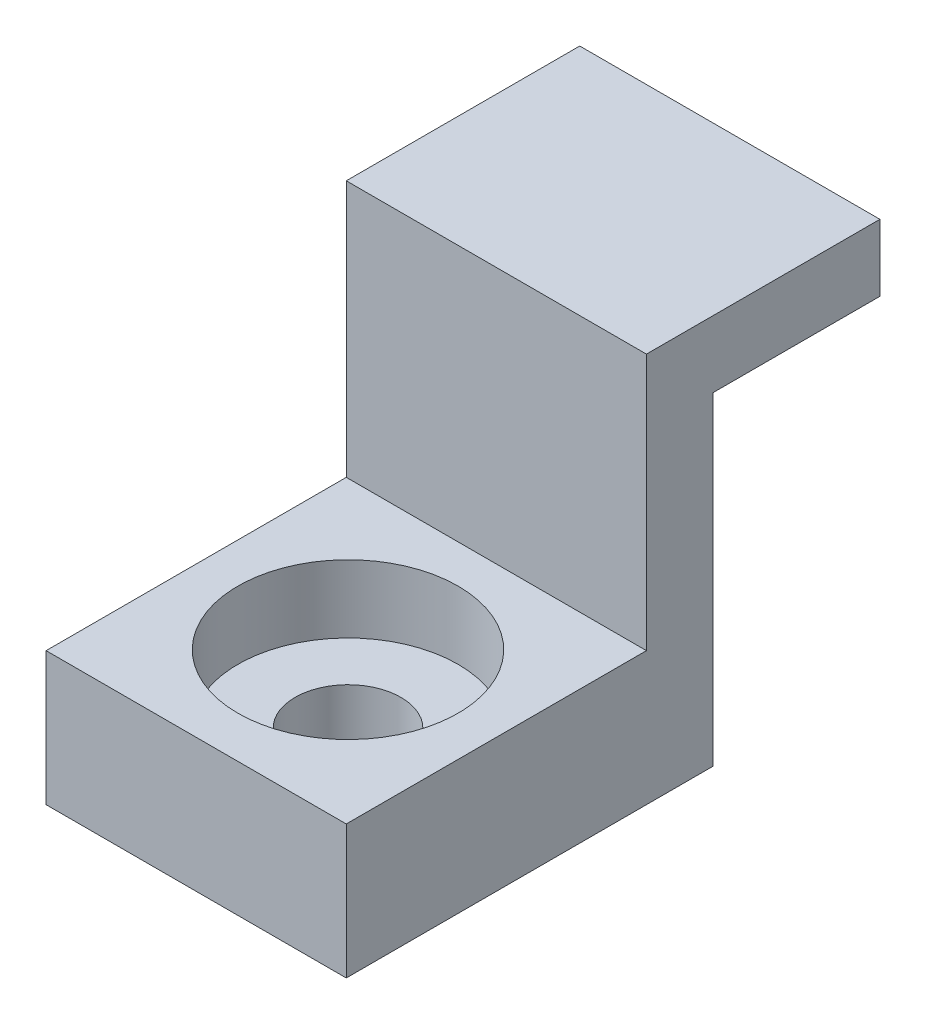
ISO-10303-21;
HEADER;
FILE_DESCRIPTION(('STEP AP214'),'2;1');
FILE_NAME('part.step','',(''),(''),'','','');
FILE_SCHEMA(('AUTOMOTIVE_DESIGN { 1 0 10303 214 1 1 1 1 }'));
ENDSEC;
DATA;
#1=APPLICATION_CONTEXT('core data for automotive mechanical design processes');
#2=APPLICATION_PROTOCOL_DEFINITION('international standard','automotive_design',2000,#1);
#3=PRODUCT_CONTEXT('',#1,'mechanical');
#4=PRODUCT('Part','Part','',(#3));
#5=PRODUCT_RELATED_PRODUCT_CATEGORY('part','',(#4));
#6=PRODUCT_DEFINITION_FORMATION('','',#4);
#7=PRODUCT_DEFINITION_CONTEXT('part definition',#1,'design');
#8=PRODUCT_DEFINITION('design','',#6,#7);
#9=PRODUCT_DEFINITION_SHAPE('','',#8);
#10=(LENGTH_UNIT() NAMED_UNIT(*) SI_UNIT(.MILLI.,.METRE.));
#11=(NAMED_UNIT(*) PLANE_ANGLE_UNIT() SI_UNIT($,.RADIAN.));
#12=(NAMED_UNIT(*) SI_UNIT($,.STERADIAN.) SOLID_ANGLE_UNIT());
#13=UNCERTAINTY_MEASURE_WITH_UNIT(LENGTH_MEASURE(1.E-05),#10,'distance_accuracy_value','');
#14=(GEOMETRIC_REPRESENTATION_CONTEXT(3) GLOBAL_UNCERTAINTY_ASSIGNED_CONTEXT((#13)) GLOBAL_UNIT_ASSIGNED_CONTEXT((#10,
#11,#12)) REPRESENTATION_CONTEXT('',''));
#15=CARTESIAN_POINT('',(0.,0.,0.));
#16=DIRECTION('',(0.,0.,1.));
#17=DIRECTION('',(1.,0.,0.));
#18=AXIS2_PLACEMENT_3D('',#15,#16,#17);
#19=CARTESIAN_POINT('',(-92.4300833436291,-1.25000000000003,11.));
#20=DIRECTION('',(0.,-1.,0.));
#21=DIRECTION('',(0.,0.,-1.));
#22=AXIS2_PLACEMENT_3D('',#19,#20,#21);
#23=PLANE('',#22);
#24=DIRECTION('',(-1.,0.,0.));
#25=VECTOR('',#24,1.);
#26=CARTESIAN_POINT('',(-92.4300833436291,-1.25000000000003,2.));
#27=LINE('',#26,#25);
#28=CARTESIAN_POINT('',(-83.4300833436291,-1.25000000000003,2.));
#29=VERTEX_POINT('',#28);
#30=CARTESIAN_POINT('',(-92.4300833436291,-1.25000000000003,2.));
#31=VERTEX_POINT('',#30);
#32=EDGE_CURVE('E52',#29,#31,#27,.T.);
#33=ORIENTED_EDGE('',*,*,#32,.T.);
#34=DIRECTION('',(0.,0.,-1.));
#35=VECTOR('',#34,1.);
#36=CARTESIAN_POINT('',(-92.4300833436291,-1.25000000000003,11.));
#37=LINE('',#36,#35);
#38=CARTESIAN_POINT('',(-92.4300833436291,-1.25000000000003,11.));
#39=VERTEX_POINT('',#38);
#40=EDGE_CURVE('E129',#39,#31,#37,.T.);
#41=ORIENTED_EDGE('',*,*,#40,.F.);
#42=DIRECTION('',(-1.,0.,0.));
#43=VECTOR('',#42,1.);
#44=CARTESIAN_POINT('',(-92.4300833436291,-1.25000000000003,11.));
#45=LINE('',#44,#43);
#46=CARTESIAN_POINT('',(-83.4300833436291,-1.25000000000003,11.));
#47=VERTEX_POINT('',#46);
#48=EDGE_CURVE('E120',#47,#39,#45,.T.);
#49=ORIENTED_EDGE('',*,*,#48,.F.);
#50=DIRECTION('',(0.,0.,-1.));
#51=VECTOR('',#50,1.);
#52=CARTESIAN_POINT('',(-83.4300833436291,-1.25000000000003,11.));
#53=LINE('',#52,#51);
#54=EDGE_CURVE('E132',#47,#29,#53,.T.);
#55=ORIENTED_EDGE('',*,*,#54,.T.);
#56=EDGE_LOOP('',(#33,#41,#49,#55));
#57=FACE_BOUND('',#56,.T.);
#58=CARTESIAN_POINT('',(-87.9300833436291,-1.25000000000003,6.44815528762161));
#59=DIRECTION('',(0.,1.,0.));
#60=DIRECTION('',(0.,0.,1.));
#61=AXIS2_PLACEMENT_3D('',#58,#59,#60);
#62=CIRCLE('',#61,3.302);
#63=CARTESIAN_POINT('',(-87.9300833436291,-1.25000000000003,9.75015528762161));
#64=VERTEX_POINT('',#63);
#65=EDGE_CURVE('E216',#64,#64,#62,.T.);
#66=ORIENTED_EDGE('',*,*,#65,.F.);
#67=EDGE_LOOP('',(#66));
#68=FACE_BOUND('',#67,.T.);
#69=ADVANCED_FACE('F37',(#57,#68),#23,.F.);
#70=CARTESIAN_POINT('',(0.,0.,2.));
#71=DIRECTION('',(0.,0.,-1.));
#72=DIRECTION('',(-1.,0.,0.));
#73=AXIS2_PLACEMENT_3D('',#70,#71,#72);
#74=PLANE('',#73);
#75=ORIENTED_EDGE('',*,*,#32,.F.);
#76=DIRECTION('',(0.,1.,0.));
#77=VECTOR('',#76,1.);
#78=CARTESIAN_POINT('',(-83.4300833436291,-5.25000000000003,2.));
#79=LINE('',#78,#77);
#80=CARTESIAN_POINT('',(-83.4300833436291,6.44999999999999,2.));
#81=VERTEX_POINT('',#80);
#82=EDGE_CURVE('E154',#29,#81,#79,.T.);
#83=ORIENTED_EDGE('',*,*,#82,.T.);
#84=DIRECTION('',(-1.,0.,0.));
#85=VECTOR('',#84,1.);
#86=CARTESIAN_POINT('',(-92.4300833436291,6.44999999999999,2.));
#87=LINE('',#86,#85);
#88=CARTESIAN_POINT('',(-92.4300833436291,6.44999999999999,2.));
#89=VERTEX_POINT('',#88);
#90=EDGE_CURVE('E157',#81,#89,#87,.T.);
#91=ORIENTED_EDGE('',*,*,#90,.T.);
#92=DIRECTION('',(0.,-1.,0.));
#93=VECTOR('',#92,1.);
#94=CARTESIAN_POINT('',(-92.4300833436291,-5.25000000000003,2.));
#95=LINE('',#94,#93);
#96=EDGE_CURVE('E152',#89,#31,#95,.T.);
#97=ORIENTED_EDGE('',*,*,#96,.T.);
#98=EDGE_LOOP('',(#75,#83,#91,#97));
#99=FACE_BOUND('',#98,.T.);
#100=ADVANCED_FACE('F187',(#99),#74,.F.);
#101=CARTESIAN_POINT('',(-92.4300833436291,-5.25000000000003,2.));
#102=DIRECTION('',(1.,0.,0.));
#103=DIRECTION('',(0.,0.,-1.));
#104=AXIS2_PLACEMENT_3D('',#101,#102,#103);
#105=PLANE('',#104);
#106=DIRECTION('',(0.,0.,-1.));
#107=VECTOR('',#106,1.);
#108=CARTESIAN_POINT('',(-92.4300833436291,6.44999999999999,2.));
#109=LINE('',#108,#107);
#110=CARTESIAN_POINT('',(-92.4300833436291,6.44999999999999,-5.));
#111=VERTEX_POINT('',#110);
#112=EDGE_CURVE('E159',#89,#111,#109,.T.);
#113=ORIENTED_EDGE('',*,*,#112,.T.);
#114=DIRECTION('',(0.,1.,0.));
#115=VECTOR('',#114,1.);
#116=CARTESIAN_POINT('',(-92.4300833436291,6.44999999999999,-5.));
#117=LINE('',#116,#115);
#118=CARTESIAN_POINT('',(-92.4300833436291,4.44999999999999,-5.));
#119=VERTEX_POINT('',#118);
#120=EDGE_CURVE('E140',#119,#111,#117,.T.);
#121=ORIENTED_EDGE('',*,*,#120,.F.);
#122=DIRECTION('',(0.,0.,1.));
#123=VECTOR('',#122,1.);
#124=CARTESIAN_POINT('',(-92.4300833436291,4.44999999999999,-5.));
#125=LINE('',#124,#123);
#126=CARTESIAN_POINT('',(-92.4300833436291,4.44999999999999,0.));
#127=VERTEX_POINT('',#126);
#128=EDGE_CURVE('E146',#119,#127,#125,.T.);
#129=ORIENTED_EDGE('',*,*,#128,.T.);
#130=DIRECTION('',(0.,-1.,0.));
#131=VECTOR('',#130,1.);
#132=CARTESIAN_POINT('',(-92.4300833436291,-5.25000000000003,0.));
#133=LINE('',#132,#131);
#134=CARTESIAN_POINT('',(-92.4300833436291,-5.25000000000003,0.));
#135=VERTEX_POINT('',#134);
#136=EDGE_CURVE('E107',#127,#135,#133,.T.);
#137=ORIENTED_EDGE('',*,*,#136,.T.);
#138=DIRECTION('',(0.,0.,-1.));
#139=VECTOR('',#138,1.);
#140=CARTESIAN_POINT('',(-92.4300833436291,-5.25000000000003,2.));
#141=LINE('',#140,#139);
#142=CARTESIAN_POINT('',(-92.4300833436291,-5.25000000000003,11.));
#143=VERTEX_POINT('',#142);
#144=EDGE_CURVE('E11',#143,#135,#141,.T.);
#145=ORIENTED_EDGE('',*,*,#144,.F.);
#146=DIRECTION('',(0.,-1.,0.));
#147=VECTOR('',#146,1.);
#148=CARTESIAN_POINT('',(-92.4300833436291,-5.25000000000003,11.));
#149=LINE('',#148,#147);
#150=EDGE_CURVE('E105',#39,#143,#149,.T.);
#151=ORIENTED_EDGE('',*,*,#150,.F.);
#152=ORIENTED_EDGE('',*,*,#40,.T.);
#153=ORIENTED_EDGE('',*,*,#96,.F.);
#154=EDGE_LOOP('',(#113,#121,#129,#137,#145,#151,#152,#153));
#155=FACE_BOUND('',#154,.T.);
#156=ADVANCED_FACE('F39',(#155),#105,.F.);
#157=CARTESIAN_POINT('',(-92.4300833436291,-5.25000000000003,2.));
#158=DIRECTION('',(0.,1.,0.));
#159=DIRECTION('',(0.,0.,1.));
#160=AXIS2_PLACEMENT_3D('',#157,#158,#159);
#161=PLANE('',#160);
#162=CARTESIAN_POINT('',(-87.9300833436291,-5.25000000000003,6.44815528762161));
#163=DIRECTION('',(0.,1.,0.));
#164=DIRECTION('',(0.,0.,1.));
#165=AXIS2_PLACEMENT_3D('',#162,#163,#164);
#166=CIRCLE('',#165,1.58750000000001);
#167=CARTESIAN_POINT('',(-87.9300833436291,-5.25000000000003,8.03565528762162));
#168=VERTEX_POINT('',#167);
#169=EDGE_CURVE('E123',#168,#168,#166,.T.);
#170=ORIENTED_EDGE('',*,*,#169,.T.);
#171=EDGE_LOOP('',(#170));
#172=FACE_BOUND('',#171,.T.);
#173=DIRECTION('',(1.,0.,0.));
#174=VECTOR('',#173,1.);
#175=CARTESIAN_POINT('',(-92.4300833436291,-5.25000000000003,0.));
#176=LINE('',#175,#174);
#177=CARTESIAN_POINT('',(-83.4300833436291,-5.25000000000003,0.));
#178=VERTEX_POINT('',#177);
#179=EDGE_CURVE('E161',#135,#178,#176,.T.);
#180=ORIENTED_EDGE('',*,*,#179,.T.);
#181=DIRECTION('',(0.,0.,-1.));
#182=VECTOR('',#181,1.);
#183=CARTESIAN_POINT('',(-83.4300833436291,-5.25000000000003,2.));
#184=LINE('',#183,#182);
#185=CARTESIAN_POINT('',(-83.4300833436291,-5.25000000000003,11.));
#186=VERTEX_POINT('',#185);
#187=EDGE_CURVE('E45',#186,#178,#184,.T.);
#188=ORIENTED_EDGE('',*,*,#187,.F.);
#189=DIRECTION('',(1.,0.,0.));
#190=VECTOR('',#189,1.);
#191=CARTESIAN_POINT('',(-92.4300833436291,-5.25000000000003,11.));
#192=LINE('',#191,#190);
#193=EDGE_CURVE('E111',#143,#186,#192,.T.);
#194=ORIENTED_EDGE('',*,*,#193,.F.);
#195=ORIENTED_EDGE('',*,*,#144,.T.);
#196=EDGE_LOOP('',(#180,#188,#194,#195));
#197=FACE_BOUND('',#196,.T.);
#198=ADVANCED_FACE('F112',(#172,#197),#161,.F.);
#199=CARTESIAN_POINT('',(-83.4300833436291,-5.25000000000003,2.));
#200=DIRECTION('',(-1.,0.,0.));
#201=DIRECTION('',(0.,0.,1.));
#202=AXIS2_PLACEMENT_3D('',#199,#200,#201);
#203=PLANE('',#202);
#204=DIRECTION('',(0.,1.,0.));
#205=VECTOR('',#204,1.);
#206=CARTESIAN_POINT('',(-83.4300833436291,-5.25000000000003,0.));
#207=LINE('',#206,#205);
#208=CARTESIAN_POINT('',(-83.4300833436291,4.44999999999999,0.));
#209=VERTEX_POINT('',#208);
#210=EDGE_CURVE('E155',#178,#209,#207,.T.);
#211=ORIENTED_EDGE('',*,*,#210,.T.);
#212=DIRECTION('',(0.,0.,1.));
#213=VECTOR('',#212,1.);
#214=CARTESIAN_POINT('',(-83.4300833436291,4.44999999999999,-5.));
#215=LINE('',#214,#213);
#216=CARTESIAN_POINT('',(-83.4300833436291,4.44999999999999,-5.));
#217=VERTEX_POINT('',#216);
#218=EDGE_CURVE('E149',#217,#209,#215,.T.);
#219=ORIENTED_EDGE('',*,*,#218,.F.);
#220=DIRECTION('',(0.,-1.,0.));
#221=VECTOR('',#220,1.);
#222=CARTESIAN_POINT('',(-83.4300833436291,6.44999999999999,-5.));
#223=LINE('',#222,#221);
#224=CARTESIAN_POINT('',(-83.4300833436291,6.44999999999999,-5.));
#225=VERTEX_POINT('',#224);
#226=EDGE_CURVE('E135',#225,#217,#223,.T.);
#227=ORIENTED_EDGE('',*,*,#226,.F.);
#228=DIRECTION('',(0.,0.,-1.));
#229=VECTOR('',#228,1.);
#230=CARTESIAN_POINT('',(-83.4300833436291,6.44999999999999,2.));
#231=LINE('',#230,#229);
#232=EDGE_CURVE('E165',#81,#225,#231,.T.);
#233=ORIENTED_EDGE('',*,*,#232,.F.);
#234=ORIENTED_EDGE('',*,*,#82,.F.);
#235=ORIENTED_EDGE('',*,*,#54,.F.);
#236=DIRECTION('',(0.,1.,0.));
#237=VECTOR('',#236,1.);
#238=CARTESIAN_POINT('',(-83.4300833436291,-5.25000000000003,11.));
#239=LINE('',#238,#237);
#240=EDGE_CURVE('E116',#186,#47,#239,.T.);
#241=ORIENTED_EDGE('',*,*,#240,.F.);
#242=ORIENTED_EDGE('',*,*,#187,.T.);
#243=EDGE_LOOP('',(#211,#219,#227,#233,#234,#235,#241,#242));
#244=FACE_BOUND('',#243,.T.);
#245=ADVANCED_FACE('F167',(#244),#203,.F.);
#246=CARTESIAN_POINT('',(-92.4300833436291,6.44999999999999,2.));
#247=DIRECTION('',(0.,-1.,0.));
#248=DIRECTION('',(0.,0.,-1.));
#249=AXIS2_PLACEMENT_3D('',#246,#247,#248);
#250=PLANE('',#249);
#251=ORIENTED_EDGE('',*,*,#232,.T.);
#252=DIRECTION('',(1.,0.,0.));
#253=VECTOR('',#252,1.);
#254=CARTESIAN_POINT('',(-83.4300833436291,6.44999999999999,-5.));
#255=LINE('',#254,#253);
#256=EDGE_CURVE('E143',#111,#225,#255,.T.);
#257=ORIENTED_EDGE('',*,*,#256,.F.);
#258=ORIENTED_EDGE('',*,*,#112,.F.);
#259=ORIENTED_EDGE('',*,*,#90,.F.);
#260=EDGE_LOOP('',(#251,#257,#258,#259));
#261=FACE_BOUND('',#260,.T.);
#262=ADVANCED_FACE('F182',(#261),#250,.F.);
#263=CARTESIAN_POINT('',(0.,0.,0.));
#264=DIRECTION('',(0.,0.,-1.));
#265=DIRECTION('',(-1.,0.,0.));
#266=AXIS2_PLACEMENT_3D('',#263,#264,#265);
#267=PLANE('',#266);
#268=DIRECTION('',(-1.,0.,0.));
#269=VECTOR('',#268,1.);
#270=CARTESIAN_POINT('',(-83.4300833436291,4.44999999999999,0.));
#271=LINE('',#270,#269);
#272=EDGE_CURVE('E60',#209,#127,#271,.T.);
#273=ORIENTED_EDGE('',*,*,#272,.F.);
#274=ORIENTED_EDGE('',*,*,#210,.F.);
#275=ORIENTED_EDGE('',*,*,#179,.F.);
#276=ORIENTED_EDGE('',*,*,#136,.F.);
#277=EDGE_LOOP('',(#273,#274,#275,#276));
#278=FACE_BOUND('',#277,.T.);
#279=ADVANCED_FACE('F170',(#278),#267,.T.);
#280=CARTESIAN_POINT('',(-83.4300833436291,4.44999999999999,-5.));
#281=DIRECTION('',(0.,1.,0.));
#282=DIRECTION('',(-1.,0.,0.));
#283=AXIS2_PLACEMENT_3D('',#280,#281,#282);
#284=PLANE('',#283);
#285=ORIENTED_EDGE('',*,*,#272,.T.);
#286=ORIENTED_EDGE('',*,*,#128,.F.);
#287=DIRECTION('',(-1.,0.,0.));
#288=VECTOR('',#287,1.);
#289=CARTESIAN_POINT('',(-83.4300833436291,4.44999999999999,-5.));
#290=LINE('',#289,#288);
#291=EDGE_CURVE('E138',#217,#119,#290,.T.);
#292=ORIENTED_EDGE('',*,*,#291,.F.);
#293=ORIENTED_EDGE('',*,*,#218,.T.);
#294=EDGE_LOOP('',(#285,#286,#292,#293));
#295=FACE_BOUND('',#294,.T.);
#296=ADVANCED_FACE('F173',(#295),#284,.F.);
#297=CARTESIAN_POINT('',(0.,0.,-5.));
#298=DIRECTION('',(0.,0.,-1.));
#299=DIRECTION('',(-1.,0.,0.));
#300=AXIS2_PLACEMENT_3D('',#297,#298,#299);
#301=PLANE('',#300);
#302=ORIENTED_EDGE('',*,*,#226,.T.);
#303=ORIENTED_EDGE('',*,*,#291,.T.);
#304=ORIENTED_EDGE('',*,*,#120,.T.);
#305=ORIENTED_EDGE('',*,*,#256,.T.);
#306=EDGE_LOOP('',(#302,#303,#304,#305));
#307=FACE_BOUND('',#306,.T.);
#308=ADVANCED_FACE('F179',(#307),#301,.T.);
#309=CARTESIAN_POINT('',(0.,0.,11.));
#310=DIRECTION('',(0.,0.,-1.));
#311=DIRECTION('',(-1.,0.,0.));
#312=AXIS2_PLACEMENT_3D('',#309,#310,#311);
#313=PLANE('',#312);
#314=ORIENTED_EDGE('',*,*,#150,.T.);
#315=ORIENTED_EDGE('',*,*,#193,.T.);
#316=ORIENTED_EDGE('',*,*,#240,.T.);
#317=ORIENTED_EDGE('',*,*,#48,.T.);
#318=EDGE_LOOP('',(#314,#315,#316,#317));
#319=FACE_BOUND('',#318,.T.);
#320=ADVANCED_FACE('F118',(#319),#313,.F.);
#321=CARTESIAN_POINT('',(-87.9300833436291,-1.25000000000003,6.44815528762161));
#322=DIRECTION('',(0.,1.,0.));
#323=DIRECTION('',(0.,0.,1.));
#324=AXIS2_PLACEMENT_3D('',#321,#322,#323);
#325=CYLINDRICAL_SURFACE('',#324,1.58750000000001);
#326=ORIENTED_EDGE('',*,*,#169,.F.);
#327=EDGE_LOOP('',(#326));
#328=FACE_BOUND('',#327,.T.);
#329=CARTESIAN_POINT('',(-87.9300833436291,-3.28200000000003,6.44815528762161));
#330=DIRECTION('',(0.,1.,0.));
#331=DIRECTION('',(0.,0.,1.));
#332=AXIS2_PLACEMENT_3D('',#329,#330,#331);
#333=CIRCLE('',#332,1.58750000000001);
#334=CARTESIAN_POINT('',(-87.9300833436291,-3.28200000000003,8.03565528762162));
#335=VERTEX_POINT('',#334);
#336=EDGE_CURVE('E210',#335,#335,#333,.T.);
#337=ORIENTED_EDGE('',*,*,#336,.T.);
#338=EDGE_LOOP('',(#337));
#339=FACE_BOUND('',#338,.T.);
#340=ADVANCED_FACE('F230',(#328,#339),#325,.F.);
#341=CARTESIAN_POINT('',(-86.3425833436291,-3.28200000000003,6.44815528762161));
#342=DIRECTION('',(0.,-1.,0.));
#343=DIRECTION('',(0.,0.,-1.));
#344=AXIS2_PLACEMENT_3D('',#341,#342,#343);
#345=PLANE('',#344);
#346=ORIENTED_EDGE('',*,*,#336,.F.);
#347=EDGE_LOOP('',(#346));
#348=FACE_BOUND('',#347,.T.);
#349=CARTESIAN_POINT('',(-87.9300833436291,-3.28200000000002,6.44815528762161));
#350=DIRECTION('',(0.,1.,0.));
#351=DIRECTION('',(0.,0.,1.));
#352=AXIS2_PLACEMENT_3D('',#349,#350,#351);
#353=CIRCLE('',#352,3.302);
#354=CARTESIAN_POINT('',(-87.9300833436291,-3.28200000000002,9.75015528762161));
#355=VERTEX_POINT('',#354);
#356=EDGE_CURVE('E212',#355,#355,#353,.T.);
#357=ORIENTED_EDGE('',*,*,#356,.T.);
#358=EDGE_LOOP('',(#357));
#359=FACE_BOUND('',#358,.T.);
#360=ADVANCED_FACE('F224',(#348,#359),#345,.F.);
#361=CARTESIAN_POINT('',(-87.9300833436291,-1.25000000000003,6.44815528762161));
#362=DIRECTION('',(0.,1.,0.));
#363=DIRECTION('',(0.,0.,1.));
#364=AXIS2_PLACEMENT_3D('',#361,#362,#363);
#365=CYLINDRICAL_SURFACE('',#364,3.302);
#366=ORIENTED_EDGE('',*,*,#356,.F.);
#367=EDGE_LOOP('',(#366));
#368=FACE_BOUND('',#367,.T.);
#369=ORIENTED_EDGE('',*,*,#65,.T.);
#370=EDGE_LOOP('',(#369));
#371=FACE_BOUND('',#370,.T.);
#372=ADVANCED_FACE('F222',(#368,#371),#365,.F.);
#373=CLOSED_SHELL('',(#69,#100,#156,#198,#245,#262,#279,#296,#308,#320,#340,#360,#372));
#374=MANIFOLD_SOLID_BREP('B2',#373);
#375=ADVANCED_BREP_SHAPE_REPRESENTATION('',(#18,#374),#14);
#376=SHAPE_DEFINITION_REPRESENTATION(#9,#375);
ENDSEC;
END-ISO-10303-21;
